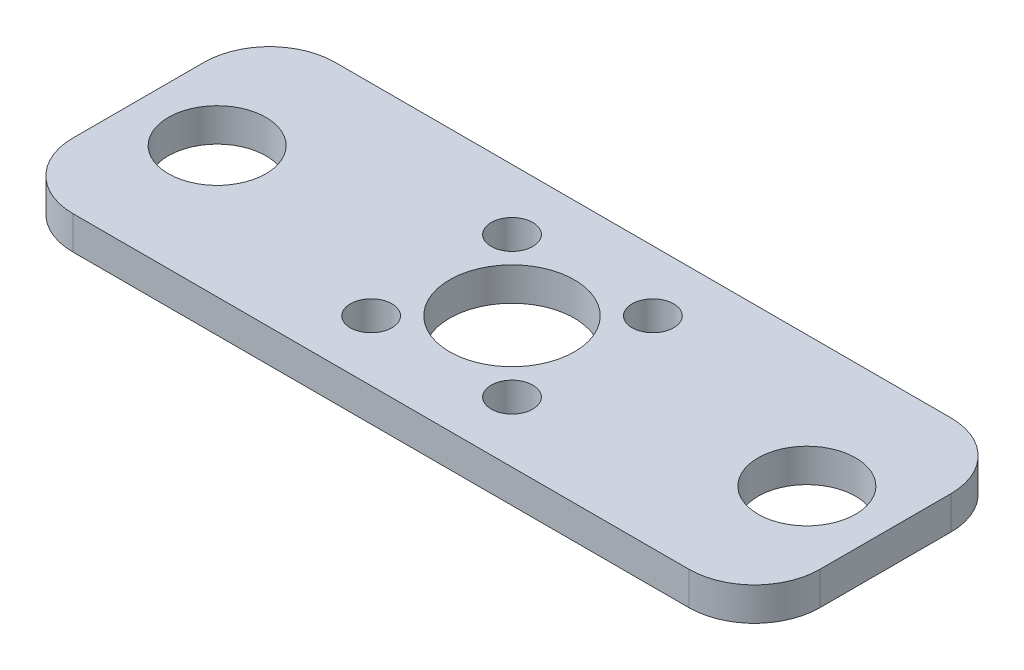
ISO-10303-21;
HEADER;
FILE_DESCRIPTION(('STEP AP214'),'2;1');
FILE_NAME('part.step','',(''),(''),'','','');
FILE_SCHEMA(('AUTOMOTIVE_DESIGN { 1 0 10303 214 1 1 1 1 }'));
ENDSEC;
DATA;
#1=APPLICATION_CONTEXT('core data for automotive mechanical design processes');
#2=APPLICATION_PROTOCOL_DEFINITION('international standard','automotive_design',2000,#1);
#3=PRODUCT_CONTEXT('',#1,'mechanical');
#4=PRODUCT('Part','Part','',(#3));
#5=PRODUCT_RELATED_PRODUCT_CATEGORY('part','',(#4));
#6=PRODUCT_DEFINITION_FORMATION('','',#4);
#7=PRODUCT_DEFINITION_CONTEXT('part definition',#1,'design');
#8=PRODUCT_DEFINITION('design','',#6,#7);
#9=PRODUCT_DEFINITION_SHAPE('','',#8);
#10=(LENGTH_UNIT() NAMED_UNIT(*) SI_UNIT(.MILLI.,.METRE.));
#11=(NAMED_UNIT(*) PLANE_ANGLE_UNIT() SI_UNIT($,.RADIAN.));
#12=(NAMED_UNIT(*) SI_UNIT($,.STERADIAN.) SOLID_ANGLE_UNIT());
#13=UNCERTAINTY_MEASURE_WITH_UNIT(LENGTH_MEASURE(1.E-05),#10,'distance_accuracy_value','');
#14=(GEOMETRIC_REPRESENTATION_CONTEXT(3) GLOBAL_UNCERTAINTY_ASSIGNED_CONTEXT((#13)) GLOBAL_UNIT_ASSIGNED_CONTEXT((#10,
#11,#12)) REPRESENTATION_CONTEXT('',''));
#15=CARTESIAN_POINT('',(0.,0.,0.));
#16=DIRECTION('',(0.,0.,1.));
#17=DIRECTION('',(1.,0.,0.));
#18=AXIS2_PLACEMENT_3D('',#15,#16,#17);
#19=CARTESIAN_POINT('',(0.,5.08,0.));
#20=DIRECTION('',(0.,1.,0.));
#21=DIRECTION('',(0.,0.,1.));
#22=AXIS2_PLACEMENT_3D('',#19,#20,#21);
#23=PLANE('',#22);
#24=CARTESIAN_POINT('',(10.75,5.08,10.75));
#25=DIRECTION('',(0.,1.,0.));
#26=DIRECTION('',(0.,0.,1.));
#27=AXIS2_PLACEMENT_3D('',#24,#25,#26);
#28=CIRCLE('',#27,3.175);
#29=CARTESIAN_POINT('',(10.75,5.08,13.925));
#30=VERTEX_POINT('',#29);
#31=EDGE_CURVE('E211',#30,#30,#28,.T.);
#32=ORIENTED_EDGE('',*,*,#31,.F.);
#33=EDGE_LOOP('',(#32));
#34=FACE_BOUND('',#33,.T.);
#35=CARTESIAN_POINT('',(10.75,5.08,-10.75));
#36=DIRECTION('',(0.,1.,0.));
#37=DIRECTION('',(0.,0.,1.));
#38=AXIS2_PLACEMENT_3D('',#35,#36,#37);
#39=CIRCLE('',#38,3.175);
#40=CARTESIAN_POINT('',(10.75,5.08,-7.575));
#41=VERTEX_POINT('',#40);
#42=EDGE_CURVE('E205',#41,#41,#39,.T.);
#43=ORIENTED_EDGE('',*,*,#42,.F.);
#44=EDGE_LOOP('',(#43));
#45=FACE_BOUND('',#44,.T.);
#46=CARTESIAN_POINT('',(-10.75,5.08,-10.75));
#47=DIRECTION('',(0.,1.,0.));
#48=DIRECTION('',(0.,0.,1.));
#49=AXIS2_PLACEMENT_3D('',#46,#47,#48);
#50=CIRCLE('',#49,3.175);
#51=CARTESIAN_POINT('',(-10.75,5.08,-7.575));
#52=VERTEX_POINT('',#51);
#53=EDGE_CURVE('E199',#52,#52,#50,.T.);
#54=ORIENTED_EDGE('',*,*,#53,.F.);
#55=EDGE_LOOP('',(#54));
#56=FACE_BOUND('',#55,.T.);
#57=CARTESIAN_POINT('',(-10.75,5.08,10.75));
#58=DIRECTION('',(0.,1.,0.));
#59=DIRECTION('',(0.,0.,1.));
#60=AXIS2_PLACEMENT_3D('',#57,#58,#59);
#61=CIRCLE('',#60,3.175);
#62=CARTESIAN_POINT('',(-10.75,5.08,13.925));
#63=VERTEX_POINT('',#62);
#64=EDGE_CURVE('E193',#63,#63,#61,.T.);
#65=ORIENTED_EDGE('',*,*,#64,.F.);
#66=EDGE_LOOP('',(#65));
#67=FACE_BOUND('',#66,.T.);
#68=CARTESIAN_POINT('',(45.,5.08,0.));
#69=DIRECTION('',(0.,1.,0.));
#70=DIRECTION('',(0.,0.,1.));
#71=AXIS2_PLACEMENT_3D('',#68,#69,#70);
#72=CIRCLE('',#71,7.45000000000001);
#73=CARTESIAN_POINT('',(45.,5.08,7.45));
#74=VERTEX_POINT('',#73);
#75=EDGE_CURVE('E178',#74,#74,#72,.T.);
#76=ORIENTED_EDGE('',*,*,#75,.F.);
#77=EDGE_LOOP('',(#76));
#78=FACE_BOUND('',#77,.T.);
#79=DIRECTION('',(0.,0.,-1.));
#80=VECTOR('',#79,1.);
#81=CARTESIAN_POINT('',(57.,5.08,20.));
#82=LINE('',#81,#80);
#83=CARTESIAN_POINT('',(57.,5.08,9.99999999999999));
#84=VERTEX_POINT('',#83);
#85=CARTESIAN_POINT('',(57.,5.08,-10.));
#86=VERTEX_POINT('',#85);
#87=EDGE_CURVE('E172',#84,#86,#82,.T.);
#88=ORIENTED_EDGE('',*,*,#87,.T.);
#89=CARTESIAN_POINT('',(47.,5.08,-10.));
#90=DIRECTION('',(0.,1.,0.));
#91=DIRECTION('',(0.,0.,1.));
#92=AXIS2_PLACEMENT_3D('',#89,#90,#91);
#93=CIRCLE('',#92,10.);
#94=CARTESIAN_POINT('',(47.,5.08,-20.));
#95=VERTEX_POINT('',#94);
#96=EDGE_CURVE('E149',#86,#95,#93,.T.);
#97=ORIENTED_EDGE('',*,*,#96,.T.);
#98=DIRECTION('',(-1.,0.,0.));
#99=VECTOR('',#98,1.);
#100=CARTESIAN_POINT('',(57.,5.08,-20.));
#101=LINE('',#100,#99);
#102=CARTESIAN_POINT('',(-47.,5.08,-20.));
#103=VERTEX_POINT('',#102);
#104=EDGE_CURVE('E120',#95,#103,#101,.T.);
#105=ORIENTED_EDGE('',*,*,#104,.T.);
#106=CARTESIAN_POINT('',(-47.,5.08,-9.99999999999999));
#107=DIRECTION('',(0.,1.,0.));
#108=DIRECTION('',(0.,0.,1.));
#109=AXIS2_PLACEMENT_3D('',#106,#107,#108);
#110=CIRCLE('',#109,10.);
#111=CARTESIAN_POINT('',(-57.,5.08,-9.99999999999999));
#112=VERTEX_POINT('',#111);
#113=EDGE_CURVE('E145',#103,#112,#110,.T.);
#114=ORIENTED_EDGE('',*,*,#113,.T.);
#115=DIRECTION('',(0.,0.,1.));
#116=VECTOR('',#115,1.);
#117=CARTESIAN_POINT('',(-57.,5.08,20.));
#118=LINE('',#117,#116);
#119=CARTESIAN_POINT('',(-57.,5.08,10.));
#120=VERTEX_POINT('',#119);
#121=EDGE_CURVE('E128',#112,#120,#118,.T.);
#122=ORIENTED_EDGE('',*,*,#121,.T.);
#123=CARTESIAN_POINT('',(-47.,5.08,10.));
#124=DIRECTION('',(0.,1.,0.));
#125=DIRECTION('',(0.,0.,1.));
#126=AXIS2_PLACEMENT_3D('',#123,#124,#125);
#127=CIRCLE('',#126,10.);
#128=CARTESIAN_POINT('',(-47.,5.08,20.));
#129=VERTEX_POINT('',#128);
#130=EDGE_CURVE('E55',#120,#129,#127,.T.);
#131=ORIENTED_EDGE('',*,*,#130,.T.);
#132=DIRECTION('',(1.,0.,0.));
#133=VECTOR('',#132,1.);
#134=CARTESIAN_POINT('',(57.,5.08,20.));
#135=LINE('',#134,#133);
#136=CARTESIAN_POINT('',(47.,5.08,20.));
#137=VERTEX_POINT('',#136);
#138=EDGE_CURVE('E131',#129,#137,#135,.T.);
#139=ORIENTED_EDGE('',*,*,#138,.T.);
#140=CARTESIAN_POINT('',(47.,5.08,9.99999999999999));
#141=DIRECTION('',(0.,1.,0.));
#142=DIRECTION('',(0.,0.,1.));
#143=AXIS2_PLACEMENT_3D('',#140,#141,#142);
#144=CIRCLE('',#143,10.);
#145=EDGE_CURVE('E147',#137,#84,#144,.T.);
#146=ORIENTED_EDGE('',*,*,#145,.T.);
#147=EDGE_LOOP('',(#88,#97,#105,#114,#122,#131,#139,#146));
#148=FACE_BOUND('',#147,.T.);
#149=CARTESIAN_POINT('',(-45.,5.08,0.));
#150=DIRECTION('',(0.,1.,0.));
#151=DIRECTION('',(0.,0.,1.));
#152=AXIS2_PLACEMENT_3D('',#149,#150,#151);
#153=CIRCLE('',#152,7.45);
#154=CARTESIAN_POINT('',(-45.,5.08,7.45));
#155=VERTEX_POINT('',#154);
#156=EDGE_CURVE('E168',#155,#155,#153,.T.);
#157=ORIENTED_EDGE('',*,*,#156,.F.);
#158=EDGE_LOOP('',(#157));
#159=FACE_BOUND('',#158,.T.);
#160=CARTESIAN_POINT('',(0.,5.08,0.));
#161=DIRECTION('',(0.,1.,0.));
#162=DIRECTION('',(0.,0.,1.));
#163=AXIS2_PLACEMENT_3D('',#160,#161,#162);
#164=CIRCLE('',#163,9.525);
#165=CARTESIAN_POINT('',(0.,5.08,9.525));
#166=VERTEX_POINT('',#165);
#167=EDGE_CURVE('E184',#166,#166,#164,.T.);
#168=ORIENTED_EDGE('',*,*,#167,.F.);
#169=EDGE_LOOP('',(#168));
#170=FACE_BOUND('',#169,.T.);
#171=ADVANCED_FACE('F33',(#34,#45,#56,#67,#78,#148,#159,#170),#23,.T.);
#172=CARTESIAN_POINT('',(0.,0.,0.));
#173=DIRECTION('',(0.,1.,0.));
#174=DIRECTION('',(0.,0.,1.));
#175=AXIS2_PLACEMENT_3D('',#172,#173,#174);
#176=PLANE('',#175);
#177=CARTESIAN_POINT('',(10.75,0.,10.75));
#178=DIRECTION('',(0.,1.,0.));
#179=DIRECTION('',(0.,0.,1.));
#180=AXIS2_PLACEMENT_3D('',#177,#178,#179);
#181=CIRCLE('',#180,3.175);
#182=CARTESIAN_POINT('',(10.75,0.,13.925));
#183=VERTEX_POINT('',#182);
#184=EDGE_CURVE('E208',#183,#183,#181,.T.);
#185=ORIENTED_EDGE('',*,*,#184,.T.);
#186=EDGE_LOOP('',(#185));
#187=FACE_BOUND('',#186,.T.);
#188=CARTESIAN_POINT('',(10.75,0.,-10.75));
#189=DIRECTION('',(0.,1.,0.));
#190=DIRECTION('',(0.,0.,1.));
#191=AXIS2_PLACEMENT_3D('',#188,#189,#190);
#192=CIRCLE('',#191,3.175);
#193=CARTESIAN_POINT('',(10.75,0.,-7.575));
#194=VERTEX_POINT('',#193);
#195=EDGE_CURVE('E202',#194,#194,#192,.T.);
#196=ORIENTED_EDGE('',*,*,#195,.T.);
#197=EDGE_LOOP('',(#196));
#198=FACE_BOUND('',#197,.T.);
#199=CARTESIAN_POINT('',(-10.75,0.,-10.75));
#200=DIRECTION('',(0.,1.,0.));
#201=DIRECTION('',(0.,0.,1.));
#202=AXIS2_PLACEMENT_3D('',#199,#200,#201);
#203=CIRCLE('',#202,3.175);
#204=CARTESIAN_POINT('',(-10.75,0.,-7.575));
#205=VERTEX_POINT('',#204);
#206=EDGE_CURVE('E196',#205,#205,#203,.T.);
#207=ORIENTED_EDGE('',*,*,#206,.T.);
#208=EDGE_LOOP('',(#207));
#209=FACE_BOUND('',#208,.T.);
#210=CARTESIAN_POINT('',(-10.75,0.,10.75));
#211=DIRECTION('',(0.,1.,0.));
#212=DIRECTION('',(0.,0.,1.));
#213=AXIS2_PLACEMENT_3D('',#210,#211,#212);
#214=CIRCLE('',#213,3.175);
#215=CARTESIAN_POINT('',(-10.75,0.,13.925));
#216=VERTEX_POINT('',#215);
#217=EDGE_CURVE('E190',#216,#216,#214,.T.);
#218=ORIENTED_EDGE('',*,*,#217,.T.);
#219=EDGE_LOOP('',(#218));
#220=FACE_BOUND('',#219,.T.);
#221=DIRECTION('',(-1.,0.,0.));
#222=VECTOR('',#221,1.);
#223=CARTESIAN_POINT('',(57.,0.,-20.));
#224=LINE('',#223,#222);
#225=CARTESIAN_POINT('',(47.,0.,-20.));
#226=VERTEX_POINT('',#225);
#227=CARTESIAN_POINT('',(-47.,0.,-20.));
#228=VERTEX_POINT('',#227);
#229=EDGE_CURVE('E117',#226,#228,#224,.T.);
#230=ORIENTED_EDGE('',*,*,#229,.F.);
#231=CARTESIAN_POINT('',(47.,0.,-10.));
#232=DIRECTION('',(0.,1.,0.));
#233=DIRECTION('',(0.,0.,1.));
#234=AXIS2_PLACEMENT_3D('',#231,#232,#233);
#235=CIRCLE('',#234,10.);
#236=CARTESIAN_POINT('',(57.,0.,-10.));
#237=VERTEX_POINT('',#236);
#238=EDGE_CURVE('E100',#226,#237,#235,.F.);
#239=ORIENTED_EDGE('',*,*,#238,.T.);
#240=DIRECTION('',(0.,0.,-1.));
#241=VECTOR('',#240,1.);
#242=CARTESIAN_POINT('',(57.,0.,20.));
#243=LINE('',#242,#241);
#244=CARTESIAN_POINT('',(57.,0.,9.99999999999999));
#245=VERTEX_POINT('',#244);
#246=EDGE_CURVE('E129',#245,#237,#243,.T.);
#247=ORIENTED_EDGE('',*,*,#246,.F.);
#248=CARTESIAN_POINT('',(47.,0.,9.99999999999999));
#249=DIRECTION('',(0.,1.,0.));
#250=DIRECTION('',(0.,0.,1.));
#251=AXIS2_PLACEMENT_3D('',#248,#249,#250);
#252=CIRCLE('',#251,10.);
#253=CARTESIAN_POINT('',(47.,0.,20.));
#254=VERTEX_POINT('',#253);
#255=EDGE_CURVE('E111',#245,#254,#252,.F.);
#256=ORIENTED_EDGE('',*,*,#255,.T.);
#257=DIRECTION('',(1.,0.,0.));
#258=VECTOR('',#257,1.);
#259=CARTESIAN_POINT('',(57.,0.,20.));
#260=LINE('',#259,#258);
#261=CARTESIAN_POINT('',(-47.,0.,20.));
#262=VERTEX_POINT('',#261);
#263=EDGE_CURVE('E133',#262,#254,#260,.T.);
#264=ORIENTED_EDGE('',*,*,#263,.F.);
#265=CARTESIAN_POINT('',(-47.,0.,10.));
#266=DIRECTION('',(0.,1.,0.));
#267=DIRECTION('',(0.,0.,1.));
#268=AXIS2_PLACEMENT_3D('',#265,#266,#267);
#269=CIRCLE('',#268,10.);
#270=CARTESIAN_POINT('',(-57.,0.,10.));
#271=VERTEX_POINT('',#270);
#272=EDGE_CURVE('E121',#262,#271,#269,.F.);
#273=ORIENTED_EDGE('',*,*,#272,.T.);
#274=DIRECTION('',(0.,0.,1.));
#275=VECTOR('',#274,1.);
#276=CARTESIAN_POINT('',(-57.,0.,20.));
#277=LINE('',#276,#275);
#278=CARTESIAN_POINT('',(-57.,0.,-9.99999999999999));
#279=VERTEX_POINT('',#278);
#280=EDGE_CURVE('E160',#279,#271,#277,.T.);
#281=ORIENTED_EDGE('',*,*,#280,.F.);
#282=CARTESIAN_POINT('',(-47.,0.,-9.99999999999999));
#283=DIRECTION('',(0.,1.,0.));
#284=DIRECTION('',(0.,0.,1.));
#285=AXIS2_PLACEMENT_3D('',#282,#283,#284);
#286=CIRCLE('',#285,10.);
#287=EDGE_CURVE('E127',#279,#228,#286,.F.);
#288=ORIENTED_EDGE('',*,*,#287,.T.);
#289=EDGE_LOOP('',(#230,#239,#247,#256,#264,#273,#281,#288));
#290=FACE_BOUND('',#289,.T.);
#291=CARTESIAN_POINT('',(-45.,0.,0.));
#292=DIRECTION('',(0.,1.,0.));
#293=DIRECTION('',(0.,0.,1.));
#294=AXIS2_PLACEMENT_3D('',#291,#292,#293);
#295=CIRCLE('',#294,7.45);
#296=CARTESIAN_POINT('',(-45.,0.,7.45));
#297=VERTEX_POINT('',#296);
#298=EDGE_CURVE('E175',#297,#297,#295,.T.);
#299=ORIENTED_EDGE('',*,*,#298,.T.);
#300=EDGE_LOOP('',(#299));
#301=FACE_BOUND('',#300,.T.);
#302=CARTESIAN_POINT('',(45.,0.,0.));
#303=DIRECTION('',(0.,1.,0.));
#304=DIRECTION('',(0.,0.,1.));
#305=AXIS2_PLACEMENT_3D('',#302,#303,#304);
#306=CIRCLE('',#305,7.45000000000001);
#307=CARTESIAN_POINT('',(45.,0.,7.45));
#308=VERTEX_POINT('',#307);
#309=EDGE_CURVE('E181',#308,#308,#306,.T.);
#310=ORIENTED_EDGE('',*,*,#309,.T.);
#311=EDGE_LOOP('',(#310));
#312=FACE_BOUND('',#311,.T.);
#313=CARTESIAN_POINT('',(0.,0.,0.));
#314=DIRECTION('',(0.,1.,0.));
#315=DIRECTION('',(0.,0.,1.));
#316=AXIS2_PLACEMENT_3D('',#313,#314,#315);
#317=CIRCLE('',#316,9.525);
#318=CARTESIAN_POINT('',(0.,0.,9.525));
#319=VERTEX_POINT('',#318);
#320=EDGE_CURVE('E187',#319,#319,#317,.T.);
#321=ORIENTED_EDGE('',*,*,#320,.T.);
#322=EDGE_LOOP('',(#321));
#323=FACE_BOUND('',#322,.T.);
#324=ADVANCED_FACE('F124',(#187,#198,#209,#220,#290,#301,#312,#323),#176,.F.);
#325=CARTESIAN_POINT('',(-57.,5.08,20.));
#326=DIRECTION('',(1.,0.,0.));
#327=DIRECTION('',(0.,0.,-1.));
#328=AXIS2_PLACEMENT_3D('',#325,#326,#327);
#329=PLANE('',#328);
#330=ORIENTED_EDGE('',*,*,#121,.F.);
#331=DIRECTION('',(0.,-1.,0.));
#332=VECTOR('',#331,1.);
#333=CARTESIAN_POINT('',(-57.,5.08,-9.99999999999999));
#334=LINE('',#333,#332);
#335=EDGE_CURVE('E11',#112,#279,#334,.T.);
#336=ORIENTED_EDGE('',*,*,#335,.T.);
#337=ORIENTED_EDGE('',*,*,#280,.T.);
#338=DIRECTION('',(0.,-1.,0.));
#339=VECTOR('',#338,1.);
#340=CARTESIAN_POINT('',(-57.,5.08,10.));
#341=LINE('',#340,#339);
#342=EDGE_CURVE('E41',#271,#120,#341,.F.);
#343=ORIENTED_EDGE('',*,*,#342,.T.);
#344=EDGE_LOOP('',(#330,#336,#337,#343));
#345=FACE_BOUND('',#344,.T.);
#346=ADVANCED_FACE('F158',(#345),#329,.F.);
#347=CARTESIAN_POINT('',(57.,5.08,20.));
#348=DIRECTION('',(0.,0.,-1.));
#349=DIRECTION('',(-1.,0.,0.));
#350=AXIS2_PLACEMENT_3D('',#347,#348,#349);
#351=PLANE('',#350);
#352=ORIENTED_EDGE('',*,*,#263,.T.);
#353=DIRECTION('',(0.,-1.,0.));
#354=VECTOR('',#353,1.);
#355=CARTESIAN_POINT('',(47.,5.08,20.));
#356=LINE('',#355,#354);
#357=EDGE_CURVE('E48',#254,#137,#356,.F.);
#358=ORIENTED_EDGE('',*,*,#357,.T.);
#359=ORIENTED_EDGE('',*,*,#138,.F.);
#360=DIRECTION('',(0.,-1.,0.));
#361=VECTOR('',#360,1.);
#362=CARTESIAN_POINT('',(-47.,5.08,20.));
#363=LINE('',#362,#361);
#364=EDGE_CURVE('E151',#129,#262,#363,.T.);
#365=ORIENTED_EDGE('',*,*,#364,.T.);
#366=EDGE_LOOP('',(#352,#358,#359,#365));
#367=FACE_BOUND('',#366,.T.);
#368=ADVANCED_FACE('F167',(#367),#351,.F.);
#369=CARTESIAN_POINT('',(57.,5.08,20.));
#370=DIRECTION('',(-1.,0.,0.));
#371=DIRECTION('',(0.,0.,1.));
#372=AXIS2_PLACEMENT_3D('',#369,#370,#371);
#373=PLANE('',#372);
#374=ORIENTED_EDGE('',*,*,#246,.T.);
#375=DIRECTION('',(0.,-1.,0.));
#376=VECTOR('',#375,1.);
#377=CARTESIAN_POINT('',(57.,5.08,-10.));
#378=LINE('',#377,#376);
#379=EDGE_CURVE('E105',#237,#86,#378,.F.);
#380=ORIENTED_EDGE('',*,*,#379,.T.);
#381=ORIENTED_EDGE('',*,*,#87,.F.);
#382=DIRECTION('',(0.,-1.,0.));
#383=VECTOR('',#382,1.);
#384=CARTESIAN_POINT('',(57.,5.08,9.99999999999999));
#385=LINE('',#384,#383);
#386=EDGE_CURVE('E110',#84,#245,#385,.T.);
#387=ORIENTED_EDGE('',*,*,#386,.T.);
#388=EDGE_LOOP('',(#374,#380,#381,#387));
#389=FACE_BOUND('',#388,.T.);
#390=ADVANCED_FACE('F267',(#389),#373,.F.);
#391=CARTESIAN_POINT('',(57.,5.08,-20.));
#392=DIRECTION('',(0.,0.,1.));
#393=DIRECTION('',(1.,0.,0.));
#394=AXIS2_PLACEMENT_3D('',#391,#392,#393);
#395=PLANE('',#394);
#396=ORIENTED_EDGE('',*,*,#104,.F.);
#397=DIRECTION('',(0.,-1.,0.));
#398=VECTOR('',#397,1.);
#399=CARTESIAN_POINT('',(47.,5.08,-20.));
#400=LINE('',#399,#398);
#401=EDGE_CURVE('E104',#95,#226,#400,.T.);
#402=ORIENTED_EDGE('',*,*,#401,.T.);
#403=ORIENTED_EDGE('',*,*,#229,.T.);
#404=DIRECTION('',(0.,-1.,0.));
#405=VECTOR('',#404,1.);
#406=CARTESIAN_POINT('',(-47.,5.08,-20.));
#407=LINE('',#406,#405);
#408=EDGE_CURVE('E122',#228,#103,#407,.F.);
#409=ORIENTED_EDGE('',*,*,#408,.T.);
#410=EDGE_LOOP('',(#396,#402,#403,#409));
#411=FACE_BOUND('',#410,.T.);
#412=ADVANCED_FACE('F116',(#411),#395,.F.);
#413=CARTESIAN_POINT('',(-45.,5.08,0.));
#414=DIRECTION('',(0.,-1.,0.));
#415=DIRECTION('',(0.,0.,-1.));
#416=AXIS2_PLACEMENT_3D('',#413,#414,#415);
#417=CYLINDRICAL_SURFACE('',#416,7.45);
#418=ORIENTED_EDGE('',*,*,#156,.T.);
#419=EDGE_LOOP('',(#418));
#420=FACE_BOUND('',#419,.T.);
#421=ORIENTED_EDGE('',*,*,#298,.F.);
#422=EDGE_LOOP('',(#421));
#423=FACE_BOUND('',#422,.T.);
#424=ADVANCED_FACE('F241',(#420,#423),#417,.F.);
#425=CARTESIAN_POINT('',(45.,5.08,0.));
#426=DIRECTION('',(0.,-1.,0.));
#427=DIRECTION('',(0.,0.,-1.));
#428=AXIS2_PLACEMENT_3D('',#425,#426,#427);
#429=CYLINDRICAL_SURFACE('',#428,7.45000000000001);
#430=ORIENTED_EDGE('',*,*,#75,.T.);
#431=EDGE_LOOP('',(#430));
#432=FACE_BOUND('',#431,.T.);
#433=ORIENTED_EDGE('',*,*,#309,.F.);
#434=EDGE_LOOP('',(#433));
#435=FACE_BOUND('',#434,.T.);
#436=ADVANCED_FACE('F237',(#432,#435),#429,.F.);
#437=CARTESIAN_POINT('',(0.,5.08,0.));
#438=DIRECTION('',(0.,-1.,0.));
#439=DIRECTION('',(0.,0.,-1.));
#440=AXIS2_PLACEMENT_3D('',#437,#438,#439);
#441=CYLINDRICAL_SURFACE('',#440,9.525);
#442=ORIENTED_EDGE('',*,*,#167,.T.);
#443=EDGE_LOOP('',(#442));
#444=FACE_BOUND('',#443,.T.);
#445=ORIENTED_EDGE('',*,*,#320,.F.);
#446=EDGE_LOOP('',(#445));
#447=FACE_BOUND('',#446,.T.);
#448=ADVANCED_FACE('F240',(#444,#447),#441,.F.);
#449=CARTESIAN_POINT('',(47.,5.08,-10.));
#450=DIRECTION('',(0.,-1.,0.));
#451=DIRECTION('',(0.,0.,-1.));
#452=AXIS2_PLACEMENT_3D('',#449,#450,#451);
#453=CYLINDRICAL_SURFACE('',#452,10.);
#454=ORIENTED_EDGE('',*,*,#96,.F.);
#455=ORIENTED_EDGE('',*,*,#379,.F.);
#456=ORIENTED_EDGE('',*,*,#238,.F.);
#457=ORIENTED_EDGE('',*,*,#401,.F.);
#458=EDGE_LOOP('',(#454,#455,#456,#457));
#459=FACE_BOUND('',#458,.T.);
#460=ADVANCED_FACE('F103',(#459),#453,.T.);
#461=CARTESIAN_POINT('',(47.,5.08,9.99999999999999));
#462=DIRECTION('',(0.,-1.,0.));
#463=DIRECTION('',(0.,0.,-1.));
#464=AXIS2_PLACEMENT_3D('',#461,#462,#463);
#465=CYLINDRICAL_SURFACE('',#464,10.);
#466=ORIENTED_EDGE('',*,*,#145,.F.);
#467=ORIENTED_EDGE('',*,*,#357,.F.);
#468=ORIENTED_EDGE('',*,*,#255,.F.);
#469=ORIENTED_EDGE('',*,*,#386,.F.);
#470=EDGE_LOOP('',(#466,#467,#468,#469));
#471=FACE_BOUND('',#470,.T.);
#472=ADVANCED_FACE('F256',(#471),#465,.T.);
#473=CARTESIAN_POINT('',(-47.,5.08,-9.99999999999999));
#474=DIRECTION('',(0.,-1.,0.));
#475=DIRECTION('',(0.,0.,-1.));
#476=AXIS2_PLACEMENT_3D('',#473,#474,#475);
#477=CYLINDRICAL_SURFACE('',#476,10.);
#478=ORIENTED_EDGE('',*,*,#113,.F.);
#479=ORIENTED_EDGE('',*,*,#408,.F.);
#480=ORIENTED_EDGE('',*,*,#287,.F.);
#481=ORIENTED_EDGE('',*,*,#335,.F.);
#482=EDGE_LOOP('',(#478,#479,#480,#481));
#483=FACE_BOUND('',#482,.T.);
#484=ADVANCED_FACE('F276',(#483),#477,.T.);
#485=CARTESIAN_POINT('',(-47.,5.08,10.));
#486=DIRECTION('',(0.,-1.,0.));
#487=DIRECTION('',(0.,0.,-1.));
#488=AXIS2_PLACEMENT_3D('',#485,#486,#487);
#489=CYLINDRICAL_SURFACE('',#488,10.);
#490=ORIENTED_EDGE('',*,*,#130,.F.);
#491=ORIENTED_EDGE('',*,*,#342,.F.);
#492=ORIENTED_EDGE('',*,*,#272,.F.);
#493=ORIENTED_EDGE('',*,*,#364,.F.);
#494=EDGE_LOOP('',(#490,#491,#492,#493));
#495=FACE_BOUND('',#494,.T.);
#496=ADVANCED_FACE('F35',(#495),#489,.T.);
#497=CARTESIAN_POINT('',(-10.75,0.,10.75));
#498=DIRECTION('',(0.,1.,0.));
#499=DIRECTION('',(0.,0.,1.));
#500=AXIS2_PLACEMENT_3D('',#497,#498,#499);
#501=CYLINDRICAL_SURFACE('',#500,3.175);
#502=ORIENTED_EDGE('',*,*,#217,.F.);
#503=EDGE_LOOP('',(#502));
#504=FACE_BOUND('',#503,.T.);
#505=ORIENTED_EDGE('',*,*,#64,.T.);
#506=EDGE_LOOP('',(#505));
#507=FACE_BOUND('',#506,.T.);
#508=ADVANCED_FACE('F259',(#504,#507),#501,.F.);
#509=CARTESIAN_POINT('',(-10.75,0.,-10.75));
#510=DIRECTION('',(0.,1.,0.));
#511=DIRECTION('',(0.,0.,1.));
#512=AXIS2_PLACEMENT_3D('',#509,#510,#511);
#513=CYLINDRICAL_SURFACE('',#512,3.175);
#514=ORIENTED_EDGE('',*,*,#206,.F.);
#515=EDGE_LOOP('',(#514));
#516=FACE_BOUND('',#515,.T.);
#517=ORIENTED_EDGE('',*,*,#53,.T.);
#518=EDGE_LOOP('',(#517));
#519=FACE_BOUND('',#518,.T.);
#520=ADVANCED_FACE('F289',(#516,#519),#513,.F.);
#521=CARTESIAN_POINT('',(10.75,0.,-10.75));
#522=DIRECTION('',(0.,1.,0.));
#523=DIRECTION('',(0.,0.,1.));
#524=AXIS2_PLACEMENT_3D('',#521,#522,#523);
#525=CYLINDRICAL_SURFACE('',#524,3.175);
#526=ORIENTED_EDGE('',*,*,#195,.F.);
#527=EDGE_LOOP('',(#526));
#528=FACE_BOUND('',#527,.T.);
#529=ORIENTED_EDGE('',*,*,#42,.T.);
#530=EDGE_LOOP('',(#529));
#531=FACE_BOUND('',#530,.T.);
#532=ADVANCED_FACE('F222',(#528,#531),#525,.F.);
#533=CARTESIAN_POINT('',(10.75,0.,10.75));
#534=DIRECTION('',(0.,1.,0.));
#535=DIRECTION('',(0.,0.,1.));
#536=AXIS2_PLACEMENT_3D('',#533,#534,#535);
#537=CYLINDRICAL_SURFACE('',#536,3.175);
#538=ORIENTED_EDGE('',*,*,#184,.F.);
#539=EDGE_LOOP('',(#538));
#540=FACE_BOUND('',#539,.T.);
#541=ORIENTED_EDGE('',*,*,#31,.T.);
#542=EDGE_LOOP('',(#541));
#543=FACE_BOUND('',#542,.T.);
#544=ADVANCED_FACE('F219',(#540,#543),#537,.F.);
#545=CLOSED_SHELL('',(#171,#324,#346,#368,#390,#412,#424,#436,#448,#460,#472,#484,#496,#508,
#520,#532,#544));
#546=MANIFOLD_SOLID_BREP('B2',#545);
#547=ADVANCED_BREP_SHAPE_REPRESENTATION('',(#18,#546),#14);
#548=SHAPE_DEFINITION_REPRESENTATION(#9,#547);
ENDSEC;
END-ISO-10303-21;
